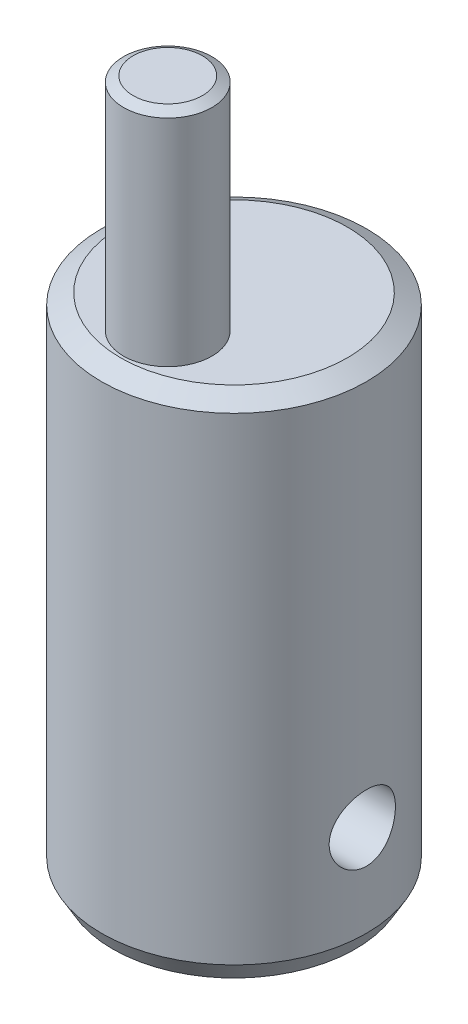
ISO-10303-21;
HEADER;
FILE_DESCRIPTION(('STEP AP214'),'2;1');
FILE_NAME('part.step','',(''),(''),'','','');
FILE_SCHEMA(('AUTOMOTIVE_DESIGN { 1 0 10303 214 1 1 1 1 }'));
ENDSEC;
DATA;
#1=APPLICATION_CONTEXT('core data for automotive mechanical design processes');
#2=APPLICATION_PROTOCOL_DEFINITION('international standard','automotive_design',2000,#1);
#3=PRODUCT_CONTEXT('',#1,'mechanical');
#4=PRODUCT('Part','Part','',(#3));
#5=PRODUCT_RELATED_PRODUCT_CATEGORY('part','',(#4));
#6=PRODUCT_DEFINITION_FORMATION('','',#4);
#7=PRODUCT_DEFINITION_CONTEXT('part definition',#1,'design');
#8=PRODUCT_DEFINITION('design','',#6,#7);
#9=PRODUCT_DEFINITION_SHAPE('','',#8);
#10=(LENGTH_UNIT() NAMED_UNIT(*) SI_UNIT(.MILLI.,.METRE.));
#11=(NAMED_UNIT(*) PLANE_ANGLE_UNIT() SI_UNIT($,.RADIAN.));
#12=(NAMED_UNIT(*) SI_UNIT($,.STERADIAN.) SOLID_ANGLE_UNIT());
#13=UNCERTAINTY_MEASURE_WITH_UNIT(LENGTH_MEASURE(1.E-05),#10,'distance_accuracy_value','');
#14=(GEOMETRIC_REPRESENTATION_CONTEXT(3) GLOBAL_UNCERTAINTY_ASSIGNED_CONTEXT((#13)) GLOBAL_UNIT_ASSIGNED_CONTEXT((#10,
#11,#12)) REPRESENTATION_CONTEXT('',''));
#15=CARTESIAN_POINT('',(0.,0.,0.));
#16=DIRECTION('',(0.,0.,1.));
#17=DIRECTION('',(1.,0.,0.));
#18=AXIS2_PLACEMENT_3D('',#15,#16,#17);
#19=CARTESIAN_POINT('',(0.,23.,0.));
#20=DIRECTION('',(0.,-1.,0.));
#21=DIRECTION('',(0.,0.,-1.));
#22=AXIS2_PLACEMENT_3D('',#19,#20,#21);
#23=CYLINDRICAL_SURFACE('',#22,6.);
#24=CARTESIAN_POINT('',(0.,0.866025403784446,0.));
#25=DIRECTION('',(0.,1.,0.));
#26=DIRECTION('',(0.,0.,1.));
#27=AXIS2_PLACEMENT_3D('',#24,#25,#26);
#28=CIRCLE('',#27,6.);
#29=CARTESIAN_POINT('',(0.,0.866025403784446,6.));
#30=VERTEX_POINT('',#29);
#31=EDGE_CURVE('E53',#30,#30,#28,.T.);
#32=ORIENTED_EDGE('',*,*,#31,.T.);
#33=EDGE_LOOP('',(#32));
#34=FACE_BOUND('',#33,.T.);
#35=CARTESIAN_POINT('',(0.,22.5,0.));
#36=DIRECTION('',(0.,1.,0.));
#37=DIRECTION('',(0.,0.,1.));
#38=AXIS2_PLACEMENT_3D('',#35,#36,#37);
#39=CIRCLE('',#38,6.);
#40=CARTESIAN_POINT('',(0.,22.5,6.));
#41=VERTEX_POINT('',#40);
#42=EDGE_CURVE('E58',#41,#41,#39,.F.);
#43=ORIENTED_EDGE('',*,*,#42,.T.);
#44=EDGE_LOOP('',(#43));
#45=FACE_BOUND('',#44,.T.);
#46=CARTESIAN_POINT('',(-6.,3.5,0.));
#47=CARTESIAN_POINT('',(-5.99999859868013,3.50000232573816,-0.0828760886697311));
#48=CARTESIAN_POINT('',(-5.99826578131828,3.50689155077379,-0.165778157830763));
#49=CARTESIAN_POINT('',(-5.99152113829892,3.534225151307,-0.329206323770533));
#50=CARTESIAN_POINT('',(-5.98650745419968,3.55467720953785,-0.409731046870739));
#51=CARTESIAN_POINT('',(-5.9737562633204,3.60843925346209,-0.566020872182577));
#52=CARTESIAN_POINT('',(-5.96602202842087,3.64173379871528,-0.641791563430003));
#53=CARTESIAN_POINT('',(-5.94865343807593,3.72018139004483,-0.786672131904427));
#54=CARTESIAN_POINT('',(-5.9390190185405,3.76533483611894,-0.855781784348759));
#55=CARTESIAN_POINT('',(-5.91867413591801,3.86720078965421,-0.98680192730092));
#56=CARTESIAN_POINT('',(-5.90794707148533,3.92411157495918,-1.04855569006107));
#57=CARTESIAN_POINT('',(-5.8867362011753,4.04745220490892,-1.1617489272033));
#58=CARTESIAN_POINT('',(-5.87625242288348,4.1138831229465,-1.21318723694913));
#59=CARTESIAN_POINT('',(-5.8565477569971,4.25559522673744,-1.30502654279903));
#60=CARTESIAN_POINT('',(-5.84734794470605,4.3309932308104,-1.34525221592536));
#61=CARTESIAN_POINT('',(-5.83149494812223,4.48774841165836,-1.41239690855053));
#62=CARTESIAN_POINT('',(-5.82484135672789,4.56910463332576,-1.43931805543933));
#63=CARTESIAN_POINT('',(-5.81500476717551,4.73374349820247,-1.47855483680429));
#64=CARTESIAN_POINT('',(-5.81175491075426,4.8169548960498,-1.49115226833334));
#65=CARTESIAN_POINT('',(-5.80889362537741,4.98436856901398,-1.50226177506785));
#66=CARTESIAN_POINT('',(-5.80928160448644,5.06857068069861,-1.50077614181798));
#67=CARTESIAN_POINT('',(-5.81359205496618,5.23341580774448,-1.48398652463928));
#68=CARTESIAN_POINT('',(-5.81742863001879,5.3140956214651,-1.46901834019052));
#69=CARTESIAN_POINT('',(-5.82806709676484,5.47176105091129,-1.42622418690311));
#70=CARTESIAN_POINT('',(-5.83486919970696,5.54874640302898,-1.39839730206942));
#71=CARTESIAN_POINT('',(-5.85075113904187,5.69773801625207,-1.33038947793715));
#72=CARTESIAN_POINT('',(-5.85985327469421,5.76968617178955,-1.29008666723291));
#73=CARTESIAN_POINT('',(-5.87929710846386,5.90591870975684,-1.19835627601495));
#74=CARTESIAN_POINT('',(-5.88963902334735,5.97020174806726,-1.14692674880884));
#75=CARTESIAN_POINT('',(-5.91075880539781,6.0912036156944,-1.03266342468122));
#76=CARTESIAN_POINT('',(-5.92154069477971,6.14765449006135,-0.96954625816586));
#77=CARTESIAN_POINT('',(-5.94205965578786,6.2492212424639,-0.8346119175037));
#78=CARTESIAN_POINT('',(-5.95179669549415,6.29433677426357,-0.762794477707944));
#79=CARTESIAN_POINT('',(-5.96917732094183,6.37205058622439,-0.612115888681392));
#80=CARTESIAN_POINT('',(-5.97681360127725,6.40460534025443,-0.533231393208624));
#81=CARTESIAN_POINT('',(-5.98907916991419,6.45591730570957,-0.370876008142883));
#82=CARTESIAN_POINT('',(-5.99370903339281,6.47467715641814,-0.287405999150485));
#83=CARTESIAN_POINT('',(-5.99935499271375,6.49745756555884,-0.120539970390027));
#84=CARTESIAN_POINT('',(-6.00046053508279,6.5018430260753,-0.0371967199882103));
#85=CARTESIAN_POINT('',(-5.99918804814451,6.49675099794451,0.129032874801507));
#86=CARTESIAN_POINT('',(-5.99681033241847,6.48727475720087,0.211919259644594));
#87=CARTESIAN_POINT('',(-5.98889581127357,6.45502909160862,0.373614268776491));
#88=CARTESIAN_POINT('',(-5.98340634185811,6.43245873652301,0.452465118968754));
#89=CARTESIAN_POINT('',(-5.96988706634134,6.37489291597155,0.605257292452511));
#90=CARTESIAN_POINT('',(-5.96185700369892,6.33989619568683,0.679198119032634));
#91=CARTESIAN_POINT('',(-5.94393307926311,6.25776387112527,0.821523134429847));
#92=CARTESIAN_POINT('',(-5.93400867366932,6.21042388760324,0.88978544183583));
#93=CARTESIAN_POINT('',(-5.91344509187419,6.10521009120303,1.01752661364325));
#94=CARTESIAN_POINT('',(-5.90280579251705,6.04733446038309,1.07700395897301));
#95=CARTESIAN_POINT('',(-5.88168956960771,5.92099803915554,1.18699056807273));
#96=CARTESIAN_POINT('',(-5.87122304187281,5.85231229699758,1.23724386762203));
#97=CARTESIAN_POINT('',(-5.85192878377239,5.70726736553428,1.3255107590127));
#98=CARTESIAN_POINT('',(-5.84310098067026,5.63090851704025,1.36352489415794));
#99=CARTESIAN_POINT('',(-5.82818094734665,5.47309427758692,1.42595142060929));
#100=CARTESIAN_POINT('',(-5.82207255291906,5.39167237165599,1.45044439665406));
#101=CARTESIAN_POINT('',(-5.81326744090184,5.22569036211089,1.48534565995378));
#102=CARTESIAN_POINT('',(-5.81056997719936,5.14113094896751,1.49575702747866));
#103=CARTESIAN_POINT('',(-5.80894901203957,4.9738789761448,1.50203859033399));
#104=CARTESIAN_POINT('',(-5.80991932728264,4.89120256487527,1.49831789778012));
#105=CARTESIAN_POINT('',(-5.81527909007843,4.72769611133202,1.47737727831287));
#106=CARTESIAN_POINT('',(-5.81966846891857,4.64686603198635,1.46015762268677));
#107=CARTESIAN_POINT('',(-5.83131260682722,4.48979154093459,1.41293131944279));
#108=CARTESIAN_POINT('',(-5.83855015236309,4.41352269475979,1.38300140468038));
#109=CARTESIAN_POINT('',(-5.85507755724829,4.26703461728631,1.31126491360507));
#110=CARTESIAN_POINT('',(-5.86436770120773,4.19681622681309,1.26945669003419));
#111=CARTESIAN_POINT('',(-5.88425634263512,4.06244537099798,1.17386774863714));
#112=CARTESIAN_POINT('',(-5.89488264831757,3.99849892657604,1.11980316291226));
#113=CARTESIAN_POINT('',(-5.91608027246286,3.88045295520459,1.00178937118974));
#114=CARTESIAN_POINT('',(-5.9266515772706,3.82635576988703,0.937837821261146));
#115=CARTESIAN_POINT('',(-5.94677655647663,3.72858869143539,0.800467586702591));
#116=CARTESIAN_POINT('',(-5.95630833365868,3.68512538632842,0.726898422316388));
#117=CARTESIAN_POINT('',(-5.97304924975118,3.61125253705947,0.573266059510477));
#118=CARTESIAN_POINT('',(-5.98026005199781,3.58083363935146,0.49320756343674));
#119=CARTESIAN_POINT('',(-5.99048059565542,3.53842816967035,0.344410253243472));
#120=CARTESIAN_POINT('',(-5.99402585052691,3.52404875694657,0.276380170908069));
#121=CARTESIAN_POINT('',(-5.99878605231948,3.50483405637806,0.138906071536283));
#122=CARTESIAN_POINT('',(-6.00000117450894,3.4999980506947,0.0694621612426164));
#123=CARTESIAN_POINT('',(-6.,3.5,0.));
#124=B_SPLINE_CURVE_WITH_KNOTS('',3,(#46,#47,#48,#49,#50,#51,#52,#53,#54,#55,#56,#57,#58,#59,
#60,#61,#62,#63,#64,#65,#66,#67,#68,#69,#70,#71,#72,#73,#74,#75,#76,#77,#78,#79,#80,#81,#82,#83,
#84,#85,#86,#87,#88,#89,#90,#91,#92,#93,#94,#95,#96,#97,#98,#99,#100,#101,#102,#103,#104,#105,
#106,#107,#108,#109,#110,#111,#112,#113,#114,#115,#116,#117,#118,#119,#120,#121,#122,#123),
.UNSPECIFIED.,.T.,.F.,(4,2,2,2,2,2,2,2,2,2,2,2,2,2,2,2,2,2,2,2,2,2,2,2,2,2,2,2,2,2,2,2,2,2,2,2,
2,2,4),(0.,0.24837371247189,0.4968882377639,0.745104902286106,0.993329940169329,
1.24614435437139,1.49898729580062,1.75558647545807,2.01214461169368,2.2635629509943,
2.51494038112697,2.76022497007018,3.00552703466038,3.25330527873879,3.50112690836163,
3.75601500969019,4.01091089558247,4.26668229009114,4.52240473688643,4.77158308949276,
5.02073901112743,5.26620274514037,5.5116912732229,5.76153587565352,6.01142363008019,
6.26744509204476,6.52345518749508,6.77792254614036,7.03233423252407,7.27943780398612,
7.52653640956034,7.77216400559447,8.01782568136901,8.2698957640991,8.52202569770417,
8.77872185499588,9.0352336382135,9.24342242942149,9.45159556043039),.UNSPECIFIED.);
#125=CARTESIAN_POINT('',(-6.,3.5,0.));
#126=VERTEX_POINT('',#125);
#127=EDGE_CURVE('E72',#126,#126,#124,.T.);
#128=ORIENTED_EDGE('',*,*,#127,.T.);
#129=EDGE_LOOP('',(#128));
#130=FACE_BOUND('',#129,.T.);
#131=CARTESIAN_POINT('',(5.80947501931113,5.,-1.5));
#132=CARTESIAN_POINT('',(5.80947660051185,4.91716954944523,-1.49999764715507));
#133=CARTESIAN_POINT('',(5.81126583608348,4.8343130607932,-1.49311574729838));
#134=CARTESIAN_POINT('',(5.81821117195949,4.67097945309558,-1.46581387527848));
#135=CARTESIAN_POINT('',(5.82336923173088,4.590503747319,-1.44538602404532));
#136=CARTESIAN_POINT('',(5.8364323475758,4.43431787708778,-1.39169471977917));
#137=CARTESIAN_POINT('',(5.84433385614245,4.3586017067686,-1.35844783671268));
#138=CARTESIAN_POINT('',(5.86198915217285,4.21381348847605,-1.28011268475685));
#139=CARTESIAN_POINT('',(5.87174301827101,4.14474172275187,-1.23502391313642));
#140=CARTESIAN_POINT('',(5.89224429813367,4.01368301284268,-1.13322505638713));
#141=CARTESIAN_POINT('',(5.90300758573818,3.95186383978997,-1.07630213262243));
#142=CARTESIAN_POINT('',(5.92417725309179,3.83854316338379,-0.952909238460399));
#143=CARTESIAN_POINT('',(5.93458359939834,3.78704262462695,-0.886438376508185));
#144=CARTESIAN_POINT('',(5.95404249312349,3.69513471942123,-0.744687120647373));
#145=CARTESIAN_POINT('',(5.96307412440355,3.65489216710312,-0.669296745717072));
#146=CARTESIAN_POINT('',(5.9785848715559,3.58771421350815,-0.512557910575657));
#147=CARTESIAN_POINT('',(5.98506436400607,3.56077684885069,-0.431210331475164));
#148=CARTESIAN_POINT('',(5.99462855308908,3.52151129925285,-0.266615255252497));
#149=CARTESIAN_POINT('',(5.99777936306589,3.50889821340405,-0.183439631729386));
#150=CARTESIAN_POINT('',(6.00056156464379,3.49774497243467,-0.0160972915576618));
#151=CARTESIAN_POINT('',(6.00019347658022,3.49920273667424,0.068069276722841));
#152=CARTESIAN_POINT('',(5.99602856972121,3.51594491015009,0.233028370758581));
#153=CARTESIAN_POINT('',(5.99230801404524,3.53092179503231,0.313854323401601));
#154=CARTESIAN_POINT('',(5.98194501914912,3.5737827620291,0.47180737112053));
#155=CARTESIAN_POINT('',(5.97530242439065,3.60166753122645,0.548934269055657));
#156=CARTESIAN_POINT('',(5.95972505820537,3.66980154241224,0.69811005525271));
#157=CARTESIAN_POINT('',(5.95077011817032,3.71016022679705,0.770106764649757));
#158=CARTESIAN_POINT('',(5.9315394228579,3.80201340746976,0.906413433510734));
#159=CARTESIAN_POINT('',(5.92126343791494,3.85350984113637,0.970722052628259));
#160=CARTESIAN_POINT('',(5.90018228261712,3.96782524518943,1.09166105262743));
#161=CARTESIAN_POINT('',(5.88937031715551,4.03091293540867,1.1480365186128));
#162=CARTESIAN_POINT('',(5.86869026110024,4.16575998412415,1.24946456394453));
#163=CARTESIAN_POINT('',(5.85882221463582,4.2375197476946,1.29451661406903));
#164=CARTESIAN_POINT('',(5.84112298098989,4.38817402048938,1.3721821935339));
#165=CARTESIAN_POINT('',(5.83330190235432,4.46710143818792,1.40473435045574));
#166=CARTESIAN_POINT('',(5.82071184083974,4.62955128084587,1.45602843095451));
#167=CARTESIAN_POINT('',(5.81594220486131,4.71307271838988,1.47477330982937));
#168=CARTESIAN_POINT('',(5.81013213623485,4.87997570091387,1.49749778319911));
#169=CARTESIAN_POINT('',(5.80899653456189,4.96330267599778,1.50185428435178));
#170=CARTESIAN_POINT('',(5.81032406088624,5.1294931619469,1.49671019430933));
#171=CARTESIAN_POINT('',(5.8127868576076,5.21235671477075,1.48721087870928));
#172=CARTESIAN_POINT('',(5.82094249172736,5.37386855897283,1.4549552783626));
#173=CARTESIAN_POINT('',(5.82658182140625,5.45256363594251,1.43241844096905));
#174=CARTESIAN_POINT('',(5.84040430962578,5.60505887471101,1.37497084900237));
#175=CARTESIAN_POINT('',(5.84858776949168,5.6788584554332,1.34005862862753));
#176=CARTESIAN_POINT('',(5.86677682255958,5.82106476672041,1.25806240076193));
#177=CARTESIAN_POINT('',(5.87681501163985,5.88933730402586,1.21075305230138));
#178=CARTESIAN_POINT('',(5.8975024984303,6.01711301768081,1.10559043940168));
#179=CARTESIAN_POINT('',(5.90815189637082,6.07661474999004,1.04773544220816));
#180=CARTESIAN_POINT('',(5.92918441818964,6.18668662554257,0.921394081477089));
#181=CARTESIAN_POINT('',(5.93955421237101,6.23699603752929,0.852677928797389));
#182=CARTESIAN_POINT('',(5.95858329968241,6.32536152017075,0.707554024042013));
#183=CARTESIAN_POINT('',(5.96724268202376,6.36341822996492,0.631146673436387));
#184=CARTESIAN_POINT('',(5.98182069442989,6.42586762071676,0.473337302596635));
#185=CARTESIAN_POINT('',(5.98775898013446,6.45035857062744,0.391976071541822));
#186=CARTESIAN_POINT('',(5.99631176037473,6.48527620076505,0.226124640478212));
#187=CARTESIAN_POINT('',(5.99892689636045,6.49570559524343,0.141635047561865));
#188=CARTESIAN_POINT('',(6.00051254113217,6.5020513843633,-0.0256252896649896));
#189=CARTESIAN_POINT('',(5.99957968320012,6.49835256364309,-0.10838074044905));
#190=CARTESIAN_POINT('',(5.99438844686135,6.4774282590585,-0.272051244622109));
#191=CARTESIAN_POINT('',(5.99013016735643,6.46020317748035,-0.35296635267133));
#192=CARTESIAN_POINT('',(5.97878149280944,6.41292167034361,-0.510256553467225));
#193=CARTESIAN_POINT('',(5.97170646753999,6.38293482002806,-0.586653741871529));
#194=CARTESIAN_POINT('',(5.95546933370076,6.31104413147101,-0.733375579562203));
#195=CARTESIAN_POINT('',(5.94630696206604,6.26913879099565,-0.803699461897578));
#196=CARTESIAN_POINT('',(5.92660874521999,6.17342714900439,-0.93810289263585));
#197=CARTESIAN_POINT('',(5.91604525418417,6.11935978563893,-1.00199248245088));
#198=CARTESIAN_POINT('',(5.89485973579863,6.0013657220393,-1.11992253040688));
#199=CARTESIAN_POINT('',(5.88423769428834,5.93743652585314,-1.17396048760228));
#200=CARTESIAN_POINT('',(5.86391213790822,5.800097878698,-1.27164303971884));
#201=CARTESIAN_POINT('',(5.85422945594827,5.72653381488106,-1.31507492916982));
#202=CARTESIAN_POINT('',(5.83715933325924,5.57291676511595,-1.3888903449235));
#203=CARTESIAN_POINT('',(5.82977022370054,5.49286855083989,-1.41928336463958));
#204=CARTESIAN_POINT('',(5.81927863109675,5.34413448225992,-1.46163379284816));
#205=CARTESIAN_POINT('',(5.8156299450082,5.27616025342421,-1.47598975589307));
#206=CARTESIAN_POINT('',(5.81072757878358,5.13879669650005,-1.4951734388599));
#207=CARTESIAN_POINT('',(5.80947369434945,5.06940748963241,-1.50000197155828));
#208=CARTESIAN_POINT('',(5.80947501931113,5.,-1.5));
#209=B_SPLINE_CURVE_WITH_KNOTS('',3,(#131,#132,#133,#134,#135,#136,#137,#138,#139,#140,#141,
#142,#143,#144,#145,#146,#147,#148,#149,#150,#151,#152,#153,#154,#155,#156,#157,#158,#159,#160,
#161,#162,#163,#164,#165,#166,#167,#168,#169,#170,#171,#172,#173,#174,#175,#176,#177,#178,#179,
#180,#181,#182,#183,#184,#185,#186,#187,#188,#189,#190,#191,#192,#193,#194,#195,#196,#197,#198,
#199,#200,#201,#202,#203,#204,#205,#206,#207,#208),.UNSPECIFIED.,.T.,.F.,(4,2,2,2,2,2,2,2,2,2,2,
2,2,2,2,2,2,2,2,2,2,2,2,2,2,2,2,2,2,2,2,2,2,2,2,2,2,2,4),(0.,0.248236465041681,0.4966174448572,
0.744678436299612,0.99274996053287,1.24574372515786,1.4987611288792,1.75530897838752,
2.01181895908255,2.26313250597208,2.51440889199612,2.76010957613368,3.00582334034872,
3.25375724552667,3.50173431281348,3.75642279943147,4.01112318719881,4.26705859205042,
4.52293920077729,4.7720614485703,5.02116076310281,5.26618443005524,5.5112371285285,
5.76109707515494,6.01099811331027,6.26715198579191,6.52329249431732,6.77755243684158,
7.03176329345423,7.27910067676474,7.52643070426189,7.77242925935827,8.01845883442843,
8.27038257949243,8.52237018939306,8.77905886370806,9.03556032819972,9.24358696306398,
9.45159585059713),.UNSPECIFIED.);
#210=CARTESIAN_POINT('',(5.80947501931113,5.,-1.5));
#211=VERTEX_POINT('',#210);
#212=EDGE_CURVE('E81',#211,#211,#209,.T.);
#213=ORIENTED_EDGE('',*,*,#212,.T.);
#214=EDGE_LOOP('',(#213));
#215=FACE_BOUND('',#214,.T.);
#216=ADVANCED_FACE('F39',(#34,#45,#130,#215),#23,.T.);
#217=CARTESIAN_POINT('',(0.,23.,0.));
#218=DIRECTION('',(0.,1.,0.));
#219=DIRECTION('',(0.,0.,1.));
#220=AXIS2_PLACEMENT_3D('',#217,#218,#219);
#221=PLANE('',#220);
#222=CARTESIAN_POINT('',(0.,23.,0.));
#223=DIRECTION('',(0.,1.,0.));
#224=DIRECTION('',(0.,0.,1.));
#225=AXIS2_PLACEMENT_3D('',#222,#223,#224);
#226=CIRCLE('',#225,5.13397459621556);
#227=CARTESIAN_POINT('',(0.,23.,5.13397459621556));
#228=VERTEX_POINT('',#227);
#229=EDGE_CURVE('E10',#228,#228,#226,.T.);
#230=ORIENTED_EDGE('',*,*,#229,.T.);
#231=EDGE_LOOP('',(#230));
#232=FACE_BOUND('',#231,.T.);
#233=CARTESIAN_POINT('',(0.,23.,3.));
#234=DIRECTION('',(0.,1.,0.));
#235=DIRECTION('',(0.,0.,1.));
#236=AXIS2_PLACEMENT_3D('',#233,#234,#235);
#237=CIRCLE('',#236,2.);
#238=CARTESIAN_POINT('',(0.,23.,5.));
#239=VERTEX_POINT('',#238);
#240=EDGE_CURVE('E123',#239,#239,#237,.T.);
#241=ORIENTED_EDGE('',*,*,#240,.F.);
#242=EDGE_LOOP('',(#241));
#243=FACE_BOUND('',#242,.T.);
#244=ADVANCED_FACE('F105',(#232,#243),#221,.T.);
#245=CARTESIAN_POINT('',(0.,0.,0.));
#246=DIRECTION('',(0.,1.,0.));
#247=DIRECTION('',(0.,0.,1.));
#248=AXIS2_PLACEMENT_3D('',#245,#246,#247);
#249=PLANE('',#248);
#250=CARTESIAN_POINT('',(0.,0.,0.));
#251=DIRECTION('',(0.,1.,0.));
#252=DIRECTION('',(0.,0.,1.));
#253=AXIS2_PLACEMENT_3D('',#250,#251,#252);
#254=CIRCLE('',#253,5.5);
#255=CARTESIAN_POINT('',(0.,0.,5.5));
#256=VERTEX_POINT('',#255);
#257=EDGE_CURVE('E48',#256,#256,#254,.F.);
#258=ORIENTED_EDGE('',*,*,#257,.T.);
#259=EDGE_LOOP('',(#258));
#260=FACE_BOUND('',#259,.T.);
#261=ADVANCED_FACE('F103',(#260),#249,.F.);
#262=CARTESIAN_POINT('',(0.,33.,3.));
#263=DIRECTION('',(0.,-1.,0.));
#264=DIRECTION('',(0.,0.,-1.));
#265=AXIS2_PLACEMENT_3D('',#262,#263,#264);
#266=CYLINDRICAL_SURFACE('',#265,2.);
#267=CARTESIAN_POINT('',(0.,32.75,3.));
#268=DIRECTION('',(0.,1.,0.));
#269=DIRECTION('',(0.,0.,1.));
#270=AXIS2_PLACEMENT_3D('',#267,#268,#269);
#271=CIRCLE('',#270,2.);
#272=CARTESIAN_POINT('',(0.,32.75,5.));
#273=VERTEX_POINT('',#272);
#274=EDGE_CURVE('E64',#273,#273,#271,.F.);
#275=ORIENTED_EDGE('',*,*,#274,.T.);
#276=EDGE_LOOP('',(#275));
#277=FACE_BOUND('',#276,.T.);
#278=ORIENTED_EDGE('',*,*,#240,.T.);
#279=EDGE_LOOP('',(#278));
#280=FACE_BOUND('',#279,.T.);
#281=ADVANCED_FACE('F99',(#277,#280),#266,.T.);
#282=CARTESIAN_POINT('',(0.,33.,3.));
#283=DIRECTION('',(0.,1.,0.));
#284=DIRECTION('',(0.,0.,1.));
#285=AXIS2_PLACEMENT_3D('',#282,#283,#284);
#286=PLANE('',#285);
#287=CARTESIAN_POINT('',(0.,33.,3.));
#288=DIRECTION('',(0.,1.,0.));
#289=DIRECTION('',(0.,0.,1.));
#290=AXIS2_PLACEMENT_3D('',#287,#288,#289);
#291=CIRCLE('',#290,1.56698729810778);
#292=CARTESIAN_POINT('',(0.,33.,4.56698729810778));
#293=VERTEX_POINT('',#292);
#294=EDGE_CURVE('E68',#293,#293,#291,.T.);
#295=ORIENTED_EDGE('',*,*,#294,.T.);
#296=EDGE_LOOP('',(#295));
#297=FACE_BOUND('',#296,.T.);
#298=ADVANCED_FACE('F94',(#297),#286,.T.);
#299=CARTESIAN_POINT('',(-6.,5.,0.));
#300=DIRECTION('',(1.,0.,0.));
#301=DIRECTION('',(0.,0.,-1.));
#302=AXIS2_PLACEMENT_3D('',#299,#300,#301);
#303=CYLINDRICAL_SURFACE('',#302,1.5);
#304=ORIENTED_EDGE('',*,*,#212,.F.);
#305=EDGE_LOOP('',(#304));
#306=FACE_BOUND('',#305,.T.);
#307=ORIENTED_EDGE('',*,*,#127,.F.);
#308=EDGE_LOOP('',(#307));
#309=FACE_BOUND('',#308,.T.);
#310=ADVANCED_FACE('F89',(#306,#309),#303,.F.);
#311=CARTESIAN_POINT('',(0.,33.,3.));
#312=DIRECTION('',(0.,-1.,0.));
#313=DIRECTION('',(0.,0.,-1.));
#314=AXIS2_PLACEMENT_3D('',#311,#312,#313);
#315=CONICAL_SURFACE('',#314,1.56698729810778,1.0471975511966);
#316=ORIENTED_EDGE('',*,*,#274,.F.);
#317=EDGE_LOOP('',(#316));
#318=FACE_BOUND('',#317,.T.);
#319=ORIENTED_EDGE('',*,*,#294,.F.);
#320=EDGE_LOOP('',(#319));
#321=FACE_BOUND('',#320,.T.);
#322=ADVANCED_FACE('F93',(#318,#321),#315,.T.);
#323=CARTESIAN_POINT('',(0.,0.866025403784446,0.));
#324=DIRECTION('',(0.,1.,0.));
#325=DIRECTION('',(0.,0.,1.));
#326=AXIS2_PLACEMENT_3D('',#323,#324,#325);
#327=CONICAL_SURFACE('',#326,6.,0.523598775598298);
#328=ORIENTED_EDGE('',*,*,#257,.F.);
#329=EDGE_LOOP('',(#328));
#330=FACE_BOUND('',#329,.T.);
#331=ORIENTED_EDGE('',*,*,#31,.F.);
#332=EDGE_LOOP('',(#331));
#333=FACE_BOUND('',#332,.T.);
#334=ADVANCED_FACE('F133',(#330,#333),#327,.T.);
#335=CARTESIAN_POINT('',(0.,23.,0.));
#336=DIRECTION('',(0.,-1.,0.));
#337=DIRECTION('',(0.,0.,-1.));
#338=AXIS2_PLACEMENT_3D('',#335,#336,#337);
#339=CONICAL_SURFACE('',#338,5.13397459621556,1.0471975511966);
#340=ORIENTED_EDGE('',*,*,#42,.F.);
#341=EDGE_LOOP('',(#340));
#342=FACE_BOUND('',#341,.T.);
#343=ORIENTED_EDGE('',*,*,#229,.F.);
#344=EDGE_LOOP('',(#343));
#345=FACE_BOUND('',#344,.T.);
#346=ADVANCED_FACE('F42',(#342,#345),#339,.T.);
#347=CLOSED_SHELL('',(#216,#244,#261,#281,#298,#310,#322,#334,#346));
#348=MANIFOLD_SOLID_BREP('B2',#347);
#349=ADVANCED_BREP_SHAPE_REPRESENTATION('',(#18,#348),#14);
#350=SHAPE_DEFINITION_REPRESENTATION(#9,#349);
ENDSEC;
END-ISO-10303-21;
